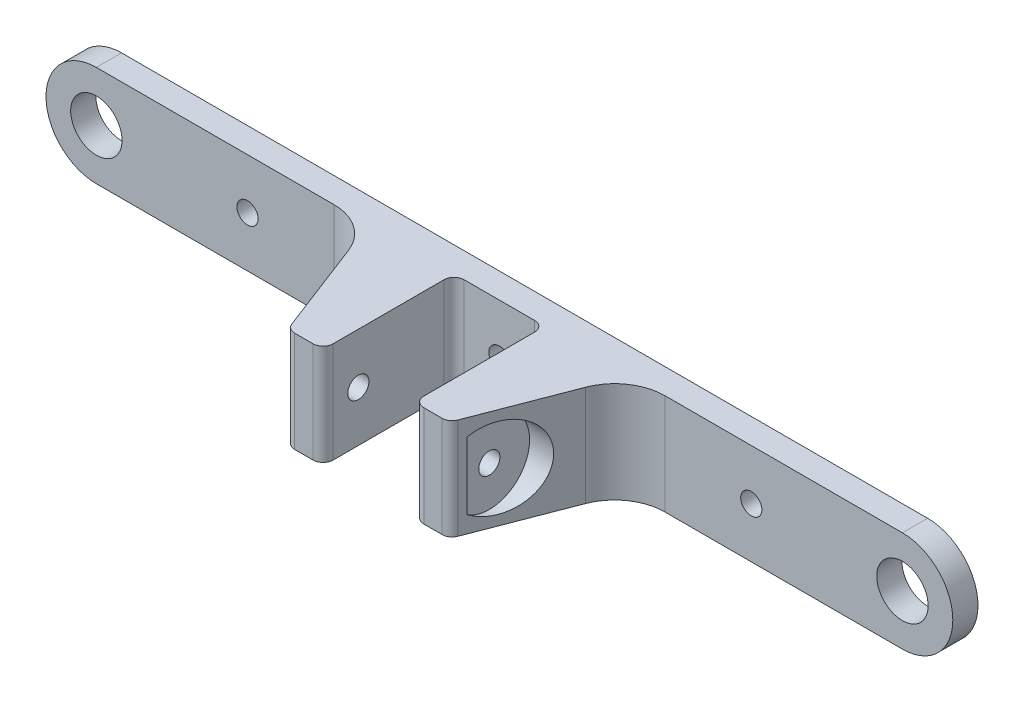
ISO-10303-21;
HEADER;
FILE_DESCRIPTION(('STEP AP214'),'2;1');
FILE_NAME('part.step','',(''),(''),'','','');
FILE_SCHEMA(('AUTOMOTIVE_DESIGN { 1 0 10303 214 1 1 1 1 }'));
ENDSEC;
DATA;
#1=APPLICATION_CONTEXT('core data for automotive mechanical design processes');
#2=APPLICATION_PROTOCOL_DEFINITION('international standard','automotive_design',2000,#1);
#3=PRODUCT_CONTEXT('',#1,'mechanical');
#4=PRODUCT('Part','Part','',(#3));
#5=PRODUCT_RELATED_PRODUCT_CATEGORY('part','',(#4));
#6=PRODUCT_DEFINITION_FORMATION('','',#4);
#7=PRODUCT_DEFINITION_CONTEXT('part definition',#1,'design');
#8=PRODUCT_DEFINITION('design','',#6,#7);
#9=PRODUCT_DEFINITION_SHAPE('','',#8);
#10=(LENGTH_UNIT() NAMED_UNIT(*) SI_UNIT(.MILLI.,.METRE.));
#11=(NAMED_UNIT(*) PLANE_ANGLE_UNIT() SI_UNIT($,.RADIAN.));
#12=(NAMED_UNIT(*) SI_UNIT($,.STERADIAN.) SOLID_ANGLE_UNIT());
#13=UNCERTAINTY_MEASURE_WITH_UNIT(LENGTH_MEASURE(1.E-05),#10,'distance_accuracy_value','');
#14=(GEOMETRIC_REPRESENTATION_CONTEXT(3) GLOBAL_UNCERTAINTY_ASSIGNED_CONTEXT((#13)) GLOBAL_UNIT_ASSIGNED_CONTEXT((#10,
#11,#12)) REPRESENTATION_CONTEXT('',''));
#15=CARTESIAN_POINT('',(0.,0.,0.));
#16=DIRECTION('',(0.,0.,1.));
#17=DIRECTION('',(1.,0.,0.));
#18=AXIS2_PLACEMENT_3D('',#15,#16,#17);
#19=CARTESIAN_POINT('',(0.,0.,31.));
#20=DIRECTION('',(0.,0.,-1.));
#21=DIRECTION('',(-1.,0.,0.));
#22=AXIS2_PLACEMENT_3D('',#19,#20,#21);
#23=PLANE('',#22);
#24=DIRECTION('',(-1.,0.,0.));
#25=VECTOR('',#24,1.);
#26=CARTESIAN_POINT('',(16.,10.,31.));
#27=LINE('',#26,#25);
#28=CARTESIAN_POINT('',(14.6264018035101,10.,31.));
#29=VERTEX_POINT('',#28);
#30=CARTESIAN_POINT('',(11.,10.,31.));
#31=VERTEX_POINT('',#30);
#32=EDGE_CURVE('E241',#29,#31,#27,.T.);
#33=ORIENTED_EDGE('',*,*,#32,.T.);
#34=DIRECTION('',(0.,1.,0.));
#35=VECTOR('',#34,1.);
#36=CARTESIAN_POINT('',(11.,0.,31.));
#37=LINE('',#36,#35);
#38=CARTESIAN_POINT('',(11.,-10.,31.));
#39=VERTEX_POINT('',#38);
#40=EDGE_CURVE('E233',#31,#39,#37,.F.);
#41=ORIENTED_EDGE('',*,*,#40,.T.);
#42=DIRECTION('',(1.,0.,0.));
#43=VECTOR('',#42,1.);
#44=CARTESIAN_POINT('',(16.,-10.,31.));
#45=LINE('',#44,#43);
#46=CARTESIAN_POINT('',(14.6264018035101,-10.,31.));
#47=VERTEX_POINT('',#46);
#48=EDGE_CURVE('E239',#39,#47,#45,.T.);
#49=ORIENTED_EDGE('',*,*,#48,.T.);
#50=DIRECTION('',(0.,1.,0.));
#51=VECTOR('',#50,1.);
#52=CARTESIAN_POINT('',(14.6264018035101,0.,31.));
#53=LINE('',#52,#51);
#54=EDGE_CURVE('E230',#47,#29,#53,.T.);
#55=ORIENTED_EDGE('',*,*,#54,.T.);
#56=EDGE_LOOP('',(#33,#41,#49,#55));
#57=FACE_BOUND('',#56,.T.);
#58=ADVANCED_FACE('F33',(#57),#23,.F.);
#59=CARTESIAN_POINT('',(-80.,0.,5.));
#60=DIRECTION('',(0.,0.,1.));
#61=DIRECTION('',(1.,0.,0.));
#62=AXIS2_PLACEMENT_3D('',#59,#60,#61);
#63=PLANE('',#62);
#64=DIRECTION('',(-1.,0.,0.));
#65=VECTOR('',#64,1.);
#66=CARTESIAN_POINT('',(-80.,10.,5.));
#67=LINE('',#66,#65);
#68=CARTESIAN_POINT('',(80.,10.,5.));
#69=VERTEX_POINT('',#68);
#70=CARTESIAN_POINT('',(32.8679909824493,10.,5.));
#71=VERTEX_POINT('',#70);
#72=EDGE_CURVE('E325',#69,#71,#67,.T.);
#73=ORIENTED_EDGE('',*,*,#72,.T.);
#74=DIRECTION('',(0.,-1.,0.));
#75=VECTOR('',#74,1.);
#76=CARTESIAN_POINT('',(32.8679909824493,0.,5.));
#77=LINE('',#76,#75);
#78=CARTESIAN_POINT('',(32.8679909824493,-10.,5.));
#79=VERTEX_POINT('',#78);
#80=EDGE_CURVE('E460',#71,#79,#77,.T.);
#81=ORIENTED_EDGE('',*,*,#80,.T.);
#82=DIRECTION('',(1.,0.,0.));
#83=VECTOR('',#82,1.);
#84=CARTESIAN_POINT('',(-80.,-10.,5.));
#85=LINE('',#84,#83);
#86=CARTESIAN_POINT('',(80.,-10.,5.));
#87=VERTEX_POINT('',#86);
#88=EDGE_CURVE('E308',#79,#87,#85,.T.);
#89=ORIENTED_EDGE('',*,*,#88,.T.);
#90=CARTESIAN_POINT('',(80.,0.,5.));
#91=DIRECTION('',(0.,0.,1.));
#92=DIRECTION('',(1.,0.,0.));
#93=AXIS2_PLACEMENT_3D('',#90,#91,#92);
#94=CIRCLE('',#93,10.);
#95=EDGE_CURVE('E312',#87,#69,#94,.T.);
#96=ORIENTED_EDGE('',*,*,#95,.T.);
#97=EDGE_LOOP('',(#73,#81,#89,#96));
#98=FACE_BOUND('',#97,.T.);
#99=CARTESIAN_POINT('',(80.,0.,5.));
#100=DIRECTION('',(0.,0.,1.));
#101=DIRECTION('',(1.,0.,0.));
#102=AXIS2_PLACEMENT_3D('',#99,#100,#101);
#103=CIRCLE('',#102,5.1);
#104=CARTESIAN_POINT('',(85.1,0.,5.));
#105=VERTEX_POINT('',#104);
#106=EDGE_CURVE('E290',#105,#105,#103,.T.);
#107=ORIENTED_EDGE('',*,*,#106,.F.);
#108=EDGE_LOOP('',(#107));
#109=FACE_BOUND('',#108,.T.);
#110=CARTESIAN_POINT('',(50.,0.,5.));
#111=DIRECTION('',(0.,0.,1.));
#112=DIRECTION('',(1.,0.,0.));
#113=AXIS2_PLACEMENT_3D('',#110,#111,#112);
#114=CIRCLE('',#113,2.1);
#115=CARTESIAN_POINT('',(52.1,0.,5.));
#116=VERTEX_POINT('',#115);
#117=EDGE_CURVE('E280',#116,#116,#114,.T.);
#118=ORIENTED_EDGE('',*,*,#117,.F.);
#119=EDGE_LOOP('',(#118));
#120=FACE_BOUND('',#119,.T.);
#121=ADVANCED_FACE('F421',(#98,#109,#120),#63,.T.);
#122=CARTESIAN_POINT('',(-80.,0.,5.));
#123=DIRECTION('',(0.,0.,-1.));
#124=DIRECTION('',(-1.,0.,0.));
#125=AXIS2_PLACEMENT_3D('',#122,#123,#124);
#126=CYLINDRICAL_SURFACE('',#125,10.);
#127=CARTESIAN_POINT('',(-80.,0.,0.));
#128=DIRECTION('',(0.,0.,1.));
#129=DIRECTION('',(1.,0.,0.));
#130=AXIS2_PLACEMENT_3D('',#127,#128,#129);
#131=CIRCLE('',#130,10.);
#132=CARTESIAN_POINT('',(-80.,10.,0.));
#133=VERTEX_POINT('',#132);
#134=CARTESIAN_POINT('',(-80.,-10.,0.));
#135=VERTEX_POINT('',#134);
#136=EDGE_CURVE('E302',#133,#135,#131,.T.);
#137=ORIENTED_EDGE('',*,*,#136,.T.);
#138=DIRECTION('',(0.,0.,-1.));
#139=VECTOR('',#138,1.);
#140=CARTESIAN_POINT('',(-80.,-10.,5.));
#141=LINE('',#140,#139);
#142=CARTESIAN_POINT('',(-80.,-10.,5.));
#143=VERTEX_POINT('',#142);
#144=EDGE_CURVE('E323',#143,#135,#141,.T.);
#145=ORIENTED_EDGE('',*,*,#144,.F.);
#146=CARTESIAN_POINT('',(-80.,0.,5.));
#147=DIRECTION('',(0.,0.,1.));
#148=DIRECTION('',(1.,0.,0.));
#149=AXIS2_PLACEMENT_3D('',#146,#147,#148);
#150=CIRCLE('',#149,10.);
#151=CARTESIAN_POINT('',(-80.,10.,5.));
#152=VERTEX_POINT('',#151);
#153=EDGE_CURVE('E305',#152,#143,#150,.T.);
#154=ORIENTED_EDGE('',*,*,#153,.F.);
#155=DIRECTION('',(0.,0.,-1.));
#156=VECTOR('',#155,1.);
#157=CARTESIAN_POINT('',(-80.,10.,5.));
#158=LINE('',#157,#156);
#159=EDGE_CURVE('E328',#152,#133,#158,.T.);
#160=ORIENTED_EDGE('',*,*,#159,.T.);
#161=EDGE_LOOP('',(#137,#145,#154,#160));
#162=FACE_BOUND('',#161,.T.);
#163=ADVANCED_FACE('F427',(#162),#126,.T.);
#164=CARTESIAN_POINT('',(-80.,-10.,5.));
#165=DIRECTION('',(0.,1.,0.));
#166=DIRECTION('',(0.,0.,1.));
#167=AXIS2_PLACEMENT_3D('',#164,#165,#166);
#168=PLANE('',#167);
#169=DIRECTION('',(0.,0.,1.));
#170=VECTOR('',#169,1.);
#171=CARTESIAN_POINT('',(-8.99999999999999,-10.,5.));
#172=LINE('',#171,#170);
#173=CARTESIAN_POINT('',(-8.99999999999999,-10.,7.));
#174=VERTEX_POINT('',#173);
#175=CARTESIAN_POINT('',(-8.99999999999999,-10.,29.));
#176=VERTEX_POINT('',#175);
#177=EDGE_CURVE('E270',#174,#176,#172,.T.);
#178=ORIENTED_EDGE('',*,*,#177,.T.);
#179=CARTESIAN_POINT('',(-11.,-10.,29.));
#180=DIRECTION('',(0.,1.,0.));
#181=DIRECTION('',(0.,0.,1.));
#182=AXIS2_PLACEMENT_3D('',#179,#180,#181);
#183=CIRCLE('',#182,2.);
#184=CARTESIAN_POINT('',(-11.,-10.,31.));
#185=VERTEX_POINT('',#184);
#186=EDGE_CURVE('E213',#176,#185,#183,.F.);
#187=ORIENTED_EDGE('',*,*,#186,.T.);
#188=CARTESIAN_POINT('',(-14.6264018035101,-10.,31.));
#189=VERTEX_POINT('',#188);
#190=EDGE_CURVE('E251',#189,#185,#45,.T.);
#191=ORIENTED_EDGE('',*,*,#190,.F.);
#192=CARTESIAN_POINT('',(-14.6264018035101,-10.,29.));
#193=DIRECTION('',(0.,1.,0.));
#194=DIRECTION('',(0.,0.,1.));
#195=AXIS2_PLACEMENT_3D('',#192,#193,#194);
#196=CIRCLE('',#195,2.);
#197=CARTESIAN_POINT('',(-16.4930930159162,-10.,29.7179581586178));
#198=VERTEX_POINT('',#197);
#199=EDGE_CURVE('E209',#189,#198,#196,.F.);
#200=ORIENTED_EDGE('',*,*,#199,.T.);
#201=DIRECTION('',(-0.358979079308872,0.,-0.933345606203059));
#202=VECTOR('',#201,1.);
#203=CARTESIAN_POINT('',(-32.9587628865981,-10.,-13.0927835051547));
#204=LINE('',#203,#202);
#205=CARTESIAN_POINT('',(-23.5345349204187,-10.,11.4102092069113));
#206=VERTEX_POINT('',#205);
#207=EDGE_CURVE('E454',#198,#206,#204,.T.);
#208=ORIENTED_EDGE('',*,*,#207,.T.);
#209=CARTESIAN_POINT('',(-32.8679909824493,-10.,15.));
#210=DIRECTION('',(0.,1.,0.));
#211=DIRECTION('',(0.,0.,1.));
#212=AXIS2_PLACEMENT_3D('',#209,#210,#211);
#213=CIRCLE('',#212,10.);
#214=CARTESIAN_POINT('',(-32.8679909824493,-10.,5.));
#215=VERTEX_POINT('',#214);
#216=EDGE_CURVE('E352',#206,#215,#213,.T.);
#217=ORIENTED_EDGE('',*,*,#216,.T.);
#218=EDGE_CURVE('E319',#143,#215,#85,.T.);
#219=ORIENTED_EDGE('',*,*,#218,.F.);
#220=ORIENTED_EDGE('',*,*,#144,.T.);
#221=DIRECTION('',(1.,0.,0.));
#222=VECTOR('',#221,1.);
#223=CARTESIAN_POINT('',(-80.,-10.,0.));
#224=LINE('',#223,#222);
#225=CARTESIAN_POINT('',(80.,-10.,0.));
#226=VERTEX_POINT('',#225);
#227=EDGE_CURVE('E480',#135,#226,#224,.T.);
#228=ORIENTED_EDGE('',*,*,#227,.T.);
#229=DIRECTION('',(0.,0.,-1.));
#230=VECTOR('',#229,1.);
#231=CARTESIAN_POINT('',(80.,-10.,5.));
#232=LINE('',#231,#230);
#233=EDGE_CURVE('E464',#87,#226,#232,.T.);
#234=ORIENTED_EDGE('',*,*,#233,.F.);
#235=ORIENTED_EDGE('',*,*,#88,.F.);
#236=CARTESIAN_POINT('',(32.8679909824493,-10.,15.));
#237=DIRECTION('',(0.,1.,0.));
#238=DIRECTION('',(0.,0.,1.));
#239=AXIS2_PLACEMENT_3D('',#236,#237,#238);
#240=CIRCLE('',#239,10.);
#241=CARTESIAN_POINT('',(23.5345349204187,-10.,11.4102092069113));
#242=VERTEX_POINT('',#241);
#243=EDGE_CURVE('E346',#79,#242,#240,.T.);
#244=ORIENTED_EDGE('',*,*,#243,.T.);
#245=DIRECTION('',(-0.358979079308872,0.,0.933345606203059));
#246=VECTOR('',#245,1.);
#247=CARTESIAN_POINT('',(12.3402061855668,-10.,40.515463917526));
#248=LINE('',#247,#246);
#249=CARTESIAN_POINT('',(16.4930930159162,-10.,29.7179581586177));
#250=VERTEX_POINT('',#249);
#251=EDGE_CURVE('E458',#242,#250,#248,.T.);
#252=ORIENTED_EDGE('',*,*,#251,.T.);
#253=CARTESIAN_POINT('',(14.6264018035101,-10.,29.));
#254=DIRECTION('',(0.,1.,0.));
#255=DIRECTION('',(0.,0.,1.));
#256=AXIS2_PLACEMENT_3D('',#253,#254,#255);
#257=CIRCLE('',#256,2.);
#258=EDGE_CURVE('E201',#250,#47,#257,.F.);
#259=ORIENTED_EDGE('',*,*,#258,.T.);
#260=ORIENTED_EDGE('',*,*,#48,.F.);
#261=CARTESIAN_POINT('',(11.,-10.,29.));
#262=DIRECTION('',(0.,1.,0.));
#263=DIRECTION('',(0.,0.,1.));
#264=AXIS2_PLACEMENT_3D('',#261,#262,#263);
#265=CIRCLE('',#264,2.);
#266=CARTESIAN_POINT('',(9.00000000000001,-10.,29.));
#267=VERTEX_POINT('',#266);
#268=EDGE_CURVE('E211',#39,#267,#265,.F.);
#269=ORIENTED_EDGE('',*,*,#268,.T.);
#270=DIRECTION('',(0.,0.,1.));
#271=VECTOR('',#270,1.);
#272=CARTESIAN_POINT('',(9.00000000000001,-10.,5.));
#273=LINE('',#272,#271);
#274=CARTESIAN_POINT('',(9.00000000000001,-10.,7.));
#275=VERTEX_POINT('',#274);
#276=EDGE_CURVE('E261',#275,#267,#273,.T.);
#277=ORIENTED_EDGE('',*,*,#276,.F.);
#278=CARTESIAN_POINT('',(7.,-10.,7.));
#279=DIRECTION('',(0.,1.,0.));
#280=DIRECTION('',(0.,0.,1.));
#281=AXIS2_PLACEMENT_3D('',#278,#279,#280);
#282=CIRCLE('',#281,2.);
#283=CARTESIAN_POINT('',(7.,-10.,5.));
#284=VERTEX_POINT('',#283);
#285=EDGE_CURVE('E204',#275,#284,#282,.T.);
#286=ORIENTED_EDGE('',*,*,#285,.T.);
#287=DIRECTION('',(1.,0.,0.));
#288=VECTOR('',#287,1.);
#289=CARTESIAN_POINT('',(9.00000000000001,-10.,5.));
#290=LINE('',#289,#288);
#291=CARTESIAN_POINT('',(-7.,-10.,5.));
#292=VERTEX_POINT('',#291);
#293=EDGE_CURVE('E267',#292,#284,#290,.T.);
#294=ORIENTED_EDGE('',*,*,#293,.F.);
#295=CARTESIAN_POINT('',(-6.99999999999999,-10.,7.));
#296=DIRECTION('',(0.,1.,0.));
#297=DIRECTION('',(0.,0.,1.));
#298=AXIS2_PLACEMENT_3D('',#295,#296,#297);
#299=CIRCLE('',#298,2.);
#300=EDGE_CURVE('E364',#292,#174,#299,.T.);
#301=ORIENTED_EDGE('',*,*,#300,.T.);
#302=EDGE_LOOP('',(#178,#187,#191,#200,#208,#217,#219,#220,#228,#234,#235,#244,#252,#259,#260,
#269,#277,#286,#294,#301));
#303=FACE_BOUND('',#302,.T.);
#304=ADVANCED_FACE('F246',(#303),#168,.F.);
#305=CARTESIAN_POINT('',(80.,0.,5.));
#306=DIRECTION('',(0.,0.,-1.));
#307=DIRECTION('',(-1.,0.,0.));
#308=AXIS2_PLACEMENT_3D('',#305,#306,#307);
#309=CYLINDRICAL_SURFACE('',#308,10.);
#310=CARTESIAN_POINT('',(80.,0.,0.));
#311=DIRECTION('',(0.,0.,1.));
#312=DIRECTION('',(1.,0.,0.));
#313=AXIS2_PLACEMENT_3D('',#310,#311,#312);
#314=CIRCLE('',#313,10.);
#315=CARTESIAN_POINT('',(80.,10.,0.));
#316=VERTEX_POINT('',#315);
#317=EDGE_CURVE('E479',#226,#316,#314,.T.);
#318=ORIENTED_EDGE('',*,*,#317,.T.);
#319=DIRECTION('',(0.,0.,-1.));
#320=VECTOR('',#319,1.);
#321=CARTESIAN_POINT('',(80.,10.,5.));
#322=LINE('',#321,#320);
#323=EDGE_CURVE('E468',#69,#316,#322,.T.);
#324=ORIENTED_EDGE('',*,*,#323,.F.);
#325=ORIENTED_EDGE('',*,*,#95,.F.);
#326=ORIENTED_EDGE('',*,*,#233,.T.);
#327=EDGE_LOOP('',(#318,#324,#325,#326));
#328=FACE_BOUND('',#327,.T.);
#329=ADVANCED_FACE('F489',(#328),#309,.T.);
#330=CARTESIAN_POINT('',(-80.,10.,5.));
#331=DIRECTION('',(0.,-1.,0.));
#332=DIRECTION('',(0.,0.,-1.));
#333=AXIS2_PLACEMENT_3D('',#330,#331,#332);
#334=PLANE('',#333);
#335=CARTESIAN_POINT('',(-11.,10.,31.));
#336=VERTEX_POINT('',#335);
#337=CARTESIAN_POINT('',(-14.6264018035101,10.,31.));
#338=VERTEX_POINT('',#337);
#339=EDGE_CURVE('E277',#336,#338,#27,.T.);
#340=ORIENTED_EDGE('',*,*,#339,.F.);
#341=CARTESIAN_POINT('',(-11.,10.,29.));
#342=DIRECTION('',(0.,-1.,0.));
#343=DIRECTION('',(0.,0.,-1.));
#344=AXIS2_PLACEMENT_3D('',#341,#342,#343);
#345=CIRCLE('',#344,2.);
#346=CARTESIAN_POINT('',(-8.99999999999999,10.,29.));
#347=VERTEX_POINT('',#346);
#348=EDGE_CURVE('E225',#336,#347,#345,.F.);
#349=ORIENTED_EDGE('',*,*,#348,.T.);
#350=DIRECTION('',(0.,0.,1.));
#351=VECTOR('',#350,1.);
#352=CARTESIAN_POINT('',(-8.99999999999999,10.,5.));
#353=LINE('',#352,#351);
#354=CARTESIAN_POINT('',(-8.99999999999999,10.,7.));
#355=VERTEX_POINT('',#354);
#356=EDGE_CURVE('E266',#355,#347,#353,.T.);
#357=ORIENTED_EDGE('',*,*,#356,.F.);
#358=CARTESIAN_POINT('',(-6.99999999999999,10.,7.));
#359=DIRECTION('',(0.,-1.,0.));
#360=DIRECTION('',(0.,0.,-1.));
#361=AXIS2_PLACEMENT_3D('',#358,#359,#360);
#362=CIRCLE('',#361,2.);
#363=CARTESIAN_POINT('',(-7.,10.,5.));
#364=VERTEX_POINT('',#363);
#365=EDGE_CURVE('E366',#355,#364,#362,.T.);
#366=ORIENTED_EDGE('',*,*,#365,.T.);
#367=DIRECTION('',(-1.,0.,0.));
#368=VECTOR('',#367,1.);
#369=CARTESIAN_POINT('',(9.00000000000001,10.,5.));
#370=LINE('',#369,#368);
#371=CARTESIAN_POINT('',(7.,10.,5.));
#372=VERTEX_POINT('',#371);
#373=EDGE_CURVE('E273',#372,#364,#370,.T.);
#374=ORIENTED_EDGE('',*,*,#373,.F.);
#375=CARTESIAN_POINT('',(7.,10.,7.));
#376=DIRECTION('',(0.,-1.,0.));
#377=DIRECTION('',(0.,0.,-1.));
#378=AXIS2_PLACEMENT_3D('',#375,#376,#377);
#379=CIRCLE('',#378,2.);
#380=CARTESIAN_POINT('',(9.00000000000001,10.,7.));
#381=VERTEX_POINT('',#380);
#382=EDGE_CURVE('E265',#372,#381,#379,.T.);
#383=ORIENTED_EDGE('',*,*,#382,.T.);
#384=DIRECTION('',(0.,0.,1.));
#385=VECTOR('',#384,1.);
#386=CARTESIAN_POINT('',(9.00000000000001,10.,5.));
#387=LINE('',#386,#385);
#388=CARTESIAN_POINT('',(9.00000000000001,10.,29.));
#389=VERTEX_POINT('',#388);
#390=EDGE_CURVE('E259',#381,#389,#387,.T.);
#391=ORIENTED_EDGE('',*,*,#390,.T.);
#392=CARTESIAN_POINT('',(11.,10.,29.));
#393=DIRECTION('',(0.,-1.,0.));
#394=DIRECTION('',(0.,0.,-1.));
#395=AXIS2_PLACEMENT_3D('',#392,#393,#394);
#396=CIRCLE('',#395,2.);
#397=EDGE_CURVE('E223',#389,#31,#396,.F.);
#398=ORIENTED_EDGE('',*,*,#397,.T.);
#399=ORIENTED_EDGE('',*,*,#32,.F.);
#400=CARTESIAN_POINT('',(14.6264018035101,10.,29.));
#401=DIRECTION('',(0.,-1.,0.));
#402=DIRECTION('',(0.,0.,-1.));
#403=AXIS2_PLACEMENT_3D('',#400,#401,#402);
#404=CIRCLE('',#403,2.);
#405=CARTESIAN_POINT('',(16.4930930159162,10.,29.7179581586177));
#406=VERTEX_POINT('',#405);
#407=EDGE_CURVE('E55',#29,#406,#404,.F.);
#408=ORIENTED_EDGE('',*,*,#407,.T.);
#409=DIRECTION('',(0.358979079308872,0.,-0.933345606203059));
#410=VECTOR('',#409,1.);
#411=CARTESIAN_POINT('',(12.3402061855668,10.,40.515463917526));
#412=LINE('',#411,#410);
#413=CARTESIAN_POINT('',(23.5345349204187,10.,11.4102092069113));
#414=VERTEX_POINT('',#413);
#415=EDGE_CURVE('E330',#406,#414,#412,.T.);
#416=ORIENTED_EDGE('',*,*,#415,.T.);
#417=CARTESIAN_POINT('',(32.8679909824493,10.,15.));
#418=DIRECTION('',(0.,-1.,0.));
#419=DIRECTION('',(0.,0.,-1.));
#420=AXIS2_PLACEMENT_3D('',#417,#418,#419);
#421=CIRCLE('',#420,10.);
#422=EDGE_CURVE('E348',#414,#71,#421,.T.);
#423=ORIENTED_EDGE('',*,*,#422,.T.);
#424=ORIENTED_EDGE('',*,*,#72,.F.);
#425=ORIENTED_EDGE('',*,*,#323,.T.);
#426=DIRECTION('',(-1.,0.,0.));
#427=VECTOR('',#426,1.);
#428=CARTESIAN_POINT('',(-80.,10.,0.));
#429=LINE('',#428,#427);
#430=EDGE_CURVE('E309',#316,#133,#429,.T.);
#431=ORIENTED_EDGE('',*,*,#430,.T.);
#432=ORIENTED_EDGE('',*,*,#159,.F.);
#433=CARTESIAN_POINT('',(-32.8679909824493,10.,5.));
#434=VERTEX_POINT('',#433);
#435=EDGE_CURVE('E329',#434,#152,#67,.T.);
#436=ORIENTED_EDGE('',*,*,#435,.F.);
#437=CARTESIAN_POINT('',(-32.8679909824493,10.,15.));
#438=DIRECTION('',(0.,-1.,0.));
#439=DIRECTION('',(0.,0.,-1.));
#440=AXIS2_PLACEMENT_3D('',#437,#438,#439);
#441=CIRCLE('',#440,10.);
#442=CARTESIAN_POINT('',(-23.5345349204187,10.,11.4102092069113));
#443=VERTEX_POINT('',#442);
#444=EDGE_CURVE('E350',#434,#443,#441,.T.);
#445=ORIENTED_EDGE('',*,*,#444,.T.);
#446=DIRECTION('',(0.358979079308872,0.,0.933345606203059));
#447=VECTOR('',#446,1.);
#448=CARTESIAN_POINT('',(-32.9587628865981,10.,-13.0927835051547));
#449=LINE('',#448,#447);
#450=CARTESIAN_POINT('',(-16.4930930159162,10.,29.7179581586178));
#451=VERTEX_POINT('',#450);
#452=EDGE_CURVE('E457',#443,#451,#449,.T.);
#453=ORIENTED_EDGE('',*,*,#452,.T.);
#454=CARTESIAN_POINT('',(-14.6264018035101,10.,29.));
#455=DIRECTION('',(0.,-1.,0.));
#456=DIRECTION('',(0.,0.,-1.));
#457=AXIS2_PLACEMENT_3D('',#454,#455,#456);
#458=CIRCLE('',#457,2.);
#459=EDGE_CURVE('E221',#451,#338,#458,.F.);
#460=ORIENTED_EDGE('',*,*,#459,.T.);
#461=EDGE_LOOP('',(#340,#349,#357,#366,#374,#383,#391,#398,#399,#408,#416,#423,#424,#425,#431,
#432,#436,#445,#453,#460));
#462=FACE_BOUND('',#461,.T.);
#463=ADVANCED_FACE('F263',(#462),#334,.F.);
#464=ORIENTED_EDGE('',*,*,#218,.T.);
#465=DIRECTION('',(0.,1.,0.));
#466=VECTOR('',#465,1.);
#467=CARTESIAN_POINT('',(-32.8679909824493,0.,5.));
#468=LINE('',#467,#466);
#469=EDGE_CURVE('E340',#215,#434,#468,.T.);
#470=ORIENTED_EDGE('',*,*,#469,.T.);
#471=ORIENTED_EDGE('',*,*,#435,.T.);
#472=ORIENTED_EDGE('',*,*,#153,.T.);
#473=EDGE_LOOP('',(#464,#470,#471,#472));
#474=FACE_BOUND('',#473,.T.);
#475=CARTESIAN_POINT('',(-50.,0.,5.));
#476=DIRECTION('',(0.,0.,1.));
#477=DIRECTION('',(1.,0.,0.));
#478=AXIS2_PLACEMENT_3D('',#475,#476,#477);
#479=CIRCLE('',#478,2.1);
#480=CARTESIAN_POINT('',(-47.9,0.,5.));
#481=VERTEX_POINT('',#480);
#482=EDGE_CURVE('E284',#481,#481,#479,.T.);
#483=ORIENTED_EDGE('',*,*,#482,.F.);
#484=EDGE_LOOP('',(#483));
#485=FACE_BOUND('',#484,.T.);
#486=CARTESIAN_POINT('',(-80.,0.,5.));
#487=DIRECTION('',(0.,0.,1.));
#488=DIRECTION('',(1.,0.,0.));
#489=AXIS2_PLACEMENT_3D('',#486,#487,#488);
#490=CIRCLE('',#489,5.1);
#491=CARTESIAN_POINT('',(-74.9,0.,5.));
#492=VERTEX_POINT('',#491);
#493=EDGE_CURVE('E296',#492,#492,#490,.T.);
#494=ORIENTED_EDGE('',*,*,#493,.F.);
#495=EDGE_LOOP('',(#494));
#496=FACE_BOUND('',#495,.T.);
#497=ADVANCED_FACE('F430',(#474,#485,#496),#63,.T.);
#498=CARTESIAN_POINT('',(-80.,0.,0.));
#499=DIRECTION('',(0.,0.,1.));
#500=DIRECTION('',(1.,0.,0.));
#501=AXIS2_PLACEMENT_3D('',#498,#499,#500);
#502=PLANE('',#501);
#503=CARTESIAN_POINT('',(0.,0.,0.));
#504=DIRECTION('',(0.,0.,1.));
#505=DIRECTION('',(1.,0.,0.));
#506=AXIS2_PLACEMENT_3D('',#503,#504,#505);
#507=CIRCLE('',#506,2.1);
#508=CARTESIAN_POINT('',(2.1,0.,0.));
#509=VERTEX_POINT('',#508);
#510=EDGE_CURVE('E194',#509,#509,#507,.T.);
#511=ORIENTED_EDGE('',*,*,#510,.T.);
#512=EDGE_LOOP('',(#511));
#513=FACE_BOUND('',#512,.T.);
#514=CARTESIAN_POINT('',(50.,0.,0.));
#515=DIRECTION('',(0.,0.,1.));
#516=DIRECTION('',(1.,0.,0.));
#517=AXIS2_PLACEMENT_3D('',#514,#515,#516);
#518=CIRCLE('',#517,2.1);
#519=CARTESIAN_POINT('',(52.1,0.,0.));
#520=VERTEX_POINT('',#519);
#521=EDGE_CURVE('E281',#520,#520,#518,.T.);
#522=ORIENTED_EDGE('',*,*,#521,.T.);
#523=EDGE_LOOP('',(#522));
#524=FACE_BOUND('',#523,.T.);
#525=CARTESIAN_POINT('',(-50.,0.,0.));
#526=DIRECTION('',(0.,0.,1.));
#527=DIRECTION('',(1.,0.,0.));
#528=AXIS2_PLACEMENT_3D('',#525,#526,#527);
#529=CIRCLE('',#528,2.1);
#530=CARTESIAN_POINT('',(-47.9,0.,0.));
#531=VERTEX_POINT('',#530);
#532=EDGE_CURVE('E287',#531,#531,#529,.T.);
#533=ORIENTED_EDGE('',*,*,#532,.T.);
#534=EDGE_LOOP('',(#533));
#535=FACE_BOUND('',#534,.T.);
#536=CARTESIAN_POINT('',(80.,0.,0.));
#537=DIRECTION('',(0.,0.,1.));
#538=DIRECTION('',(1.,0.,0.));
#539=AXIS2_PLACEMENT_3D('',#536,#537,#538);
#540=CIRCLE('',#539,5.1);
#541=CARTESIAN_POINT('',(85.1,0.,0.));
#542=VERTEX_POINT('',#541);
#543=EDGE_CURVE('E293',#542,#542,#540,.T.);
#544=ORIENTED_EDGE('',*,*,#543,.T.);
#545=EDGE_LOOP('',(#544));
#546=FACE_BOUND('',#545,.T.);
#547=CARTESIAN_POINT('',(-80.,0.,0.));
#548=DIRECTION('',(0.,0.,1.));
#549=DIRECTION('',(1.,0.,0.));
#550=AXIS2_PLACEMENT_3D('',#547,#548,#549);
#551=CIRCLE('',#550,5.1);
#552=CARTESIAN_POINT('',(-74.9,0.,0.));
#553=VERTEX_POINT('',#552);
#554=EDGE_CURVE('E299',#553,#553,#551,.T.);
#555=ORIENTED_EDGE('',*,*,#554,.T.);
#556=EDGE_LOOP('',(#555));
#557=FACE_BOUND('',#556,.T.);
#558=ORIENTED_EDGE('',*,*,#136,.F.);
#559=ORIENTED_EDGE('',*,*,#430,.F.);
#560=ORIENTED_EDGE('',*,*,#317,.F.);
#561=ORIENTED_EDGE('',*,*,#227,.F.);
#562=EDGE_LOOP('',(#558,#559,#560,#561));
#563=FACE_BOUND('',#562,.T.);
#564=ADVANCED_FACE('F487',(#513,#524,#535,#546,#557,#563),#502,.F.);
#565=CARTESIAN_POINT('',(-80.,0.,0.));
#566=DIRECTION('',(0.,0.,1.));
#567=DIRECTION('',(1.,0.,0.));
#568=AXIS2_PLACEMENT_3D('',#565,#566,#567);
#569=CYLINDRICAL_SURFACE('',#568,5.1);
#570=ORIENTED_EDGE('',*,*,#554,.F.);
#571=EDGE_LOOP('',(#570));
#572=FACE_BOUND('',#571,.T.);
#573=ORIENTED_EDGE('',*,*,#493,.T.);
#574=EDGE_LOOP('',(#573));
#575=FACE_BOUND('',#574,.T.);
#576=ADVANCED_FACE('F565',(#572,#575),#569,.F.);
#577=CARTESIAN_POINT('',(80.,0.,0.));
#578=DIRECTION('',(0.,0.,1.));
#579=DIRECTION('',(1.,0.,0.));
#580=AXIS2_PLACEMENT_3D('',#577,#578,#579);
#581=CYLINDRICAL_SURFACE('',#580,5.1);
#582=ORIENTED_EDGE('',*,*,#543,.F.);
#583=EDGE_LOOP('',(#582));
#584=FACE_BOUND('',#583,.T.);
#585=ORIENTED_EDGE('',*,*,#106,.T.);
#586=EDGE_LOOP('',(#585));
#587=FACE_BOUND('',#586,.T.);
#588=ADVANCED_FACE('F572',(#584,#587),#581,.F.);
#589=CARTESIAN_POINT('',(-50.,0.,0.));
#590=DIRECTION('',(0.,0.,1.));
#591=DIRECTION('',(1.,0.,0.));
#592=AXIS2_PLACEMENT_3D('',#589,#590,#591);
#593=CYLINDRICAL_SURFACE('',#592,2.1);
#594=ORIENTED_EDGE('',*,*,#532,.F.);
#595=EDGE_LOOP('',(#594));
#596=FACE_BOUND('',#595,.T.);
#597=ORIENTED_EDGE('',*,*,#482,.T.);
#598=EDGE_LOOP('',(#597));
#599=FACE_BOUND('',#598,.T.);
#600=ADVANCED_FACE('F443',(#596,#599),#593,.F.);
#601=CARTESIAN_POINT('',(50.,0.,0.));
#602=DIRECTION('',(0.,0.,1.));
#603=DIRECTION('',(1.,0.,0.));
#604=AXIS2_PLACEMENT_3D('',#601,#602,#603);
#605=CYLINDRICAL_SURFACE('',#604,2.1);
#606=ORIENTED_EDGE('',*,*,#521,.F.);
#607=EDGE_LOOP('',(#606));
#608=FACE_BOUND('',#607,.T.);
#609=ORIENTED_EDGE('',*,*,#117,.T.);
#610=EDGE_LOOP('',(#609));
#611=FACE_BOUND('',#610,.T.);
#612=ADVANCED_FACE('F435',(#608,#611),#605,.F.);
#613=ORIENTED_EDGE('',*,*,#190,.T.);
#614=DIRECTION('',(0.,-1.,0.));
#615=VECTOR('',#614,1.);
#616=CARTESIAN_POINT('',(-11.,0.,31.));
#617=LINE('',#616,#615);
#618=EDGE_CURVE('E218',#185,#336,#617,.F.);
#619=ORIENTED_EDGE('',*,*,#618,.T.);
#620=ORIENTED_EDGE('',*,*,#339,.T.);
#621=DIRECTION('',(0.,-1.,0.));
#622=VECTOR('',#621,1.);
#623=CARTESIAN_POINT('',(-14.6264018035101,0.,31.));
#624=LINE('',#623,#622);
#625=EDGE_CURVE('E215',#338,#189,#624,.T.);
#626=ORIENTED_EDGE('',*,*,#625,.T.);
#627=EDGE_LOOP('',(#613,#619,#620,#626));
#628=FACE_BOUND('',#627,.T.);
#629=ADVANCED_FACE('F423',(#628),#23,.F.);
#630=CARTESIAN_POINT('',(16.,10.,30.9999999999998));
#631=DIRECTION('',(-0.933345606203059,0.,-0.358979079308872));
#632=DIRECTION('',(0.,1.,0.));
#633=AXIS2_PLACEMENT_3D('',#630,#631,#632);
#634=PLANE('',#633);
#635=DIRECTION('',(0.,1.,0.));
#636=VECTOR('',#635,1.);
#637=CARTESIAN_POINT('',(17.,10.,28.3999999999998));
#638=LINE('',#637,#636);
#639=CARTESIAN_POINT('',(17.,-6.68131723539614,28.3999999999998));
#640=VERTEX_POINT('',#639);
#641=CARTESIAN_POINT('',(17.,6.68131723539615,28.3999999999998));
#642=VERTEX_POINT('',#641);
#643=EDGE_CURVE('E374',#640,#642,#638,.T.);
#644=ORIENTED_EDGE('',*,*,#643,.T.);
#645=CARTESIAN_POINT('',(18.6923076923076,0.,24.));
#646=DIRECTION('',(-0.933345606203059,0.,-0.358979079308872));
#647=DIRECTION('',(-0.358979079308872,0.,0.933345606203059));
#648=AXIS2_PLACEMENT_3D('',#645,#646,#647);
#649=ELLIPSE('',#648,8.57131586288254,8.);
#650=EDGE_CURVE('E198',#642,#640,#649,.T.);
#651=ORIENTED_EDGE('',*,*,#650,.T.);
#652=EDGE_LOOP('',(#644,#651));
#653=FACE_BOUND('',#652,.T.);
#654=ORIENTED_EDGE('',*,*,#415,.F.);
#655=DIRECTION('',(0.,1.,0.));
#656=VECTOR('',#655,1.);
#657=CARTESIAN_POINT('',(16.4930930159162,10.,29.7179581586177));
#658=LINE('',#657,#656);
#659=EDGE_CURVE('E11',#406,#250,#658,.F.);
#660=ORIENTED_EDGE('',*,*,#659,.T.);
#661=ORIENTED_EDGE('',*,*,#251,.F.);
#662=DIRECTION('',(0.,-1.,0.));
#663=VECTOR('',#662,1.);
#664=CARTESIAN_POINT('',(23.5345349204187,10.,11.4102092069113));
#665=LINE('',#664,#663);
#666=EDGE_CURVE('E339',#242,#414,#665,.F.);
#667=ORIENTED_EDGE('',*,*,#666,.T.);
#668=EDGE_LOOP('',(#654,#660,#661,#667));
#669=FACE_BOUND('',#668,.T.);
#670=ADVANCED_FACE('F434',(#653,#669),#634,.F.);
#671=CARTESIAN_POINT('',(-16.,10.,30.9999999999998));
#672=DIRECTION('',(0.933345606203059,0.,-0.358979079308872));
#673=DIRECTION('',(0.,-1.,0.));
#674=AXIS2_PLACEMENT_3D('',#671,#672,#673);
#675=PLANE('',#674);
#676=DIRECTION('',(0.,-1.,0.));
#677=VECTOR('',#676,1.);
#678=CARTESIAN_POINT('',(-17.,10.,28.3999999999998));
#679=LINE('',#678,#677);
#680=CARTESIAN_POINT('',(-17.,6.68131723539613,28.3999999999998));
#681=VERTEX_POINT('',#680);
#682=CARTESIAN_POINT('',(-17.,-6.68131723539613,28.3999999999998));
#683=VERTEX_POINT('',#682);
#684=EDGE_CURVE('E181',#681,#683,#679,.T.);
#685=ORIENTED_EDGE('',*,*,#684,.T.);
#686=CARTESIAN_POINT('',(-18.6923076923076,0.,24.));
#687=DIRECTION('',(0.933345606203059,0.,-0.358979079308872));
#688=DIRECTION('',(0.358979079308872,0.,0.933345606203059));
#689=AXIS2_PLACEMENT_3D('',#686,#687,#688);
#690=ELLIPSE('',#689,8.57131586288255,8.);
#691=EDGE_CURVE('E193',#683,#681,#690,.T.);
#692=ORIENTED_EDGE('',*,*,#691,.T.);
#693=EDGE_LOOP('',(#685,#692));
#694=FACE_BOUND('',#693,.T.);
#695=ORIENTED_EDGE('',*,*,#207,.F.);
#696=DIRECTION('',(0.,-1.,0.));
#697=VECTOR('',#696,1.);
#698=CARTESIAN_POINT('',(-16.4930930159162,10.,29.7179581586177));
#699=LINE('',#698,#697);
#700=EDGE_CURVE('E41',#198,#451,#699,.F.);
#701=ORIENTED_EDGE('',*,*,#700,.T.);
#702=ORIENTED_EDGE('',*,*,#452,.F.);
#703=DIRECTION('',(0.,1.,0.));
#704=VECTOR('',#703,1.);
#705=CARTESIAN_POINT('',(-23.5345349204187,10.,11.4102092069113));
#706=LINE('',#705,#704);
#707=EDGE_CURVE('E343',#443,#206,#706,.F.);
#708=ORIENTED_EDGE('',*,*,#707,.T.);
#709=EDGE_LOOP('',(#695,#701,#702,#708));
#710=FACE_BOUND('',#709,.T.);
#711=ADVANCED_FACE('F196',(#694,#710),#675,.F.);
#712=CARTESIAN_POINT('',(32.8679909824493,0.,15.));
#713=DIRECTION('',(0.,-1.,0.));
#714=DIRECTION('',(1.,0.,0.));
#715=AXIS2_PLACEMENT_3D('',#712,#713,#714);
#716=CYLINDRICAL_SURFACE('',#715,10.);
#717=ORIENTED_EDGE('',*,*,#422,.F.);
#718=ORIENTED_EDGE('',*,*,#666,.F.);
#719=ORIENTED_EDGE('',*,*,#243,.F.);
#720=ORIENTED_EDGE('',*,*,#80,.F.);
#721=EDGE_LOOP('',(#717,#718,#719,#720));
#722=FACE_BOUND('',#721,.T.);
#723=ADVANCED_FACE('F497',(#722),#716,.F.);
#724=CARTESIAN_POINT('',(-32.8679909824493,0.,15.));
#725=DIRECTION('',(0.,1.,0.));
#726=DIRECTION('',(0.,0.,1.));
#727=AXIS2_PLACEMENT_3D('',#724,#725,#726);
#728=CYLINDRICAL_SURFACE('',#727,10.);
#729=ORIENTED_EDGE('',*,*,#216,.F.);
#730=ORIENTED_EDGE('',*,*,#707,.F.);
#731=ORIENTED_EDGE('',*,*,#444,.F.);
#732=ORIENTED_EDGE('',*,*,#469,.F.);
#733=EDGE_LOOP('',(#729,#730,#731,#732));
#734=FACE_BOUND('',#733,.T.);
#735=ADVANCED_FACE('F540',(#734),#728,.F.);
#736=CARTESIAN_POINT('',(9.00000000000001,-10.,5.));
#737=DIRECTION('',(1.,0.,0.));
#738=DIRECTION('',(0.,0.,-1.));
#739=AXIS2_PLACEMENT_3D('',#736,#737,#738);
#740=PLANE('',#739);
#741=CARTESIAN_POINT('',(9.00000000000001,0.,24.));
#742=DIRECTION('',(1.,0.,0.));
#743=DIRECTION('',(0.,0.,-1.));
#744=AXIS2_PLACEMENT_3D('',#741,#742,#743);
#745=CIRCLE('',#744,2.1);
#746=CARTESIAN_POINT('',(9.00000000000001,0.,21.9));
#747=VERTEX_POINT('',#746);
#748=EDGE_CURVE('E373',#747,#747,#745,.T.);
#749=ORIENTED_EDGE('',*,*,#748,.T.);
#750=EDGE_LOOP('',(#749));
#751=FACE_BOUND('',#750,.T.);
#752=ORIENTED_EDGE('',*,*,#276,.T.);
#753=DIRECTION('',(0.,1.,0.));
#754=VECTOR('',#753,1.);
#755=CARTESIAN_POINT('',(9.00000000000001,-10.,29.));
#756=LINE('',#755,#754);
#757=EDGE_CURVE('E227',#267,#389,#756,.T.);
#758=ORIENTED_EDGE('',*,*,#757,.T.);
#759=ORIENTED_EDGE('',*,*,#390,.F.);
#760=DIRECTION('',(0.,1.,0.));
#761=VECTOR('',#760,1.);
#762=CARTESIAN_POINT('',(9.00000000000001,-10.,7.));
#763=LINE('',#762,#761);
#764=EDGE_CURVE('E362',#381,#275,#763,.F.);
#765=ORIENTED_EDGE('',*,*,#764,.T.);
#766=EDGE_LOOP('',(#752,#758,#759,#765));
#767=FACE_BOUND('',#766,.T.);
#768=ADVANCED_FACE('F258',(#751,#767),#740,.F.);
#769=CARTESIAN_POINT('',(-8.99999999999999,-10.,5.));
#770=DIRECTION('',(-1.,0.,0.));
#771=DIRECTION('',(0.,0.,1.));
#772=AXIS2_PLACEMENT_3D('',#769,#770,#771);
#773=PLANE('',#772);
#774=CARTESIAN_POINT('',(-8.99999999999999,0.,24.));
#775=DIRECTION('',(-1.,0.,0.));
#776=DIRECTION('',(0.,0.,1.));
#777=AXIS2_PLACEMENT_3D('',#774,#775,#776);
#778=CIRCLE('',#777,2.1);
#779=CARTESIAN_POINT('',(-8.99999999999999,0.,26.1));
#780=VERTEX_POINT('',#779);
#781=EDGE_CURVE('E370',#780,#780,#778,.T.);
#782=ORIENTED_EDGE('',*,*,#781,.T.);
#783=EDGE_LOOP('',(#782));
#784=FACE_BOUND('',#783,.T.);
#785=ORIENTED_EDGE('',*,*,#356,.T.);
#786=DIRECTION('',(0.,-1.,0.));
#787=VECTOR('',#786,1.);
#788=CARTESIAN_POINT('',(-8.99999999999999,-10.,29.));
#789=LINE('',#788,#787);
#790=EDGE_CURVE('E197',#347,#176,#789,.T.);
#791=ORIENTED_EDGE('',*,*,#790,.T.);
#792=ORIENTED_EDGE('',*,*,#177,.F.);
#793=DIRECTION('',(0.,-1.,0.));
#794=VECTOR('',#793,1.);
#795=CARTESIAN_POINT('',(-8.99999999999999,-10.,7.));
#796=LINE('',#795,#794);
#797=EDGE_CURVE('E360',#174,#355,#796,.F.);
#798=ORIENTED_EDGE('',*,*,#797,.T.);
#799=EDGE_LOOP('',(#785,#791,#792,#798));
#800=FACE_BOUND('',#799,.T.);
#801=ADVANCED_FACE('F395',(#784,#800),#773,.F.);
#802=CARTESIAN_POINT('',(0.,0.,5.));
#803=DIRECTION('',(0.,0.,1.));
#804=DIRECTION('',(1.,0.,0.));
#805=AXIS2_PLACEMENT_3D('',#802,#803,#804);
#806=PLANE('',#805);
#807=CARTESIAN_POINT('',(0.,0.,5.));
#808=DIRECTION('',(0.,0.,1.));
#809=DIRECTION('',(1.,0.,0.));
#810=AXIS2_PLACEMENT_3D('',#807,#808,#809);
#811=CIRCLE('',#810,2.1);
#812=CARTESIAN_POINT('',(2.1,0.,5.));
#813=VERTEX_POINT('',#812);
#814=EDGE_CURVE('E788',#813,#813,#811,.T.);
#815=ORIENTED_EDGE('',*,*,#814,.F.);
#816=EDGE_LOOP('',(#815));
#817=FACE_BOUND('',#816,.T.);
#818=ORIENTED_EDGE('',*,*,#373,.T.);
#819=DIRECTION('',(0.,-1.,0.));
#820=VECTOR('',#819,1.);
#821=CARTESIAN_POINT('',(-6.99999999999999,0.,5.));
#822=LINE('',#821,#820);
#823=EDGE_CURVE('E357',#364,#292,#822,.T.);
#824=ORIENTED_EDGE('',*,*,#823,.T.);
#825=ORIENTED_EDGE('',*,*,#293,.T.);
#826=DIRECTION('',(0.,1.,0.));
#827=VECTOR('',#826,1.);
#828=CARTESIAN_POINT('',(7.,0.,5.));
#829=LINE('',#828,#827);
#830=EDGE_CURVE('E354',#284,#372,#829,.T.);
#831=ORIENTED_EDGE('',*,*,#830,.T.);
#832=EDGE_LOOP('',(#818,#824,#825,#831));
#833=FACE_BOUND('',#832,.T.);
#834=ADVANCED_FACE('F403',(#817,#833),#806,.T.);
#835=CARTESIAN_POINT('',(-6.99999999999999,0.,7.));
#836=DIRECTION('',(0.,-1.,0.));
#837=DIRECTION('',(0.,0.,-1.));
#838=AXIS2_PLACEMENT_3D('',#835,#836,#837);
#839=CYLINDRICAL_SURFACE('',#838,2.);
#840=ORIENTED_EDGE('',*,*,#365,.F.);
#841=ORIENTED_EDGE('',*,*,#797,.F.);
#842=ORIENTED_EDGE('',*,*,#300,.F.);
#843=ORIENTED_EDGE('',*,*,#823,.F.);
#844=EDGE_LOOP('',(#840,#841,#842,#843));
#845=FACE_BOUND('',#844,.T.);
#846=ADVANCED_FACE('F400',(#845),#839,.F.);
#847=CARTESIAN_POINT('',(7.,0.,7.));
#848=DIRECTION('',(0.,1.,0.));
#849=DIRECTION('',(0.,0.,1.));
#850=AXIS2_PLACEMENT_3D('',#847,#848,#849);
#851=CYLINDRICAL_SURFACE('',#850,2.);
#852=ORIENTED_EDGE('',*,*,#285,.F.);
#853=ORIENTED_EDGE('',*,*,#764,.F.);
#854=ORIENTED_EDGE('',*,*,#382,.F.);
#855=ORIENTED_EDGE('',*,*,#830,.F.);
#856=EDGE_LOOP('',(#852,#853,#854,#855));
#857=FACE_BOUND('',#856,.T.);
#858=ADVANCED_FACE('F407',(#857),#851,.F.);
#859=CARTESIAN_POINT('',(90.,0.,24.));
#860=DIRECTION('',(-1.,0.,0.));
#861=DIRECTION('',(0.,0.,1.));
#862=AXIS2_PLACEMENT_3D('',#859,#860,#861);
#863=CYLINDRICAL_SURFACE('',#862,2.1);
#864=CARTESIAN_POINT('',(-17.,0.,24.));
#865=DIRECTION('',(1.,0.,0.));
#866=DIRECTION('',(0.,0.,-1.));
#867=AXIS2_PLACEMENT_3D('',#864,#865,#866);
#868=CIRCLE('',#867,2.1);
#869=CARTESIAN_POINT('',(-17.,0.,21.9));
#870=VERTEX_POINT('',#869);
#871=EDGE_CURVE('E189',#870,#870,#868,.F.);
#872=ORIENTED_EDGE('',*,*,#871,.T.);
#873=EDGE_LOOP('',(#872));
#874=FACE_BOUND('',#873,.T.);
#875=ORIENTED_EDGE('',*,*,#781,.F.);
#876=EDGE_LOOP('',(#875));
#877=FACE_BOUND('',#876,.T.);
#878=ADVANCED_FACE('F409',(#874,#877),#863,.F.);
#879=CARTESIAN_POINT('',(17.,0.,24.));
#880=DIRECTION('',(-1.,0.,0.));
#881=DIRECTION('',(0.,0.,1.));
#882=AXIS2_PLACEMENT_3D('',#879,#880,#881);
#883=CIRCLE('',#882,2.1);
#884=CARTESIAN_POINT('',(17.,0.,26.1));
#885=VERTEX_POINT('',#884);
#886=EDGE_CURVE('E375',#885,#885,#883,.F.);
#887=ORIENTED_EDGE('',*,*,#886,.T.);
#888=EDGE_LOOP('',(#887));
#889=FACE_BOUND('',#888,.T.);
#890=ORIENTED_EDGE('',*,*,#748,.F.);
#891=EDGE_LOOP('',(#890));
#892=FACE_BOUND('',#891,.T.);
#893=ADVANCED_FACE('F415',(#889,#892),#863,.F.);
#894=CARTESIAN_POINT('',(43.,0.,24.));
#895=DIRECTION('',(-1.,0.,0.));
#896=DIRECTION('',(0.,0.,1.));
#897=AXIS2_PLACEMENT_3D('',#894,#895,#896);
#898=CYLINDRICAL_SURFACE('',#897,8.);
#899=CARTESIAN_POINT('',(17.,0.,24.));
#900=DIRECTION('',(-1.,0.,0.));
#901=DIRECTION('',(0.,0.,1.));
#902=AXIS2_PLACEMENT_3D('',#899,#900,#901);
#903=CIRCLE('',#902,8.);
#904=EDGE_CURVE('E188',#642,#640,#903,.T.);
#905=ORIENTED_EDGE('',*,*,#904,.T.);
#906=ORIENTED_EDGE('',*,*,#650,.F.);
#907=EDGE_LOOP('',(#905,#906));
#908=FACE_BOUND('',#907,.T.);
#909=ADVANCED_FACE('F529',(#908),#898,.F.);
#910=CARTESIAN_POINT('',(17.,0.,24.));
#911=DIRECTION('',(-1.,0.,0.));
#912=DIRECTION('',(0.,0.,1.));
#913=AXIS2_PLACEMENT_3D('',#910,#911,#912);
#914=PLANE('',#913);
#915=ORIENTED_EDGE('',*,*,#886,.F.);
#916=EDGE_LOOP('',(#915));
#917=FACE_BOUND('',#916,.T.);
#918=ORIENTED_EDGE('',*,*,#904,.F.);
#919=ORIENTED_EDGE('',*,*,#643,.F.);
#920=EDGE_LOOP('',(#918,#919));
#921=FACE_BOUND('',#920,.T.);
#922=ADVANCED_FACE('F523',(#917,#921),#914,.F.);
#923=CARTESIAN_POINT('',(-90.,0.,24.));
#924=DIRECTION('',(1.,0.,0.));
#925=DIRECTION('',(0.,0.,-1.));
#926=AXIS2_PLACEMENT_3D('',#923,#924,#925);
#927=CYLINDRICAL_SURFACE('',#926,8.);
#928=CARTESIAN_POINT('',(-17.,0.,24.));
#929=DIRECTION('',(1.,0.,0.));
#930=DIRECTION('',(0.,0.,-1.));
#931=AXIS2_PLACEMENT_3D('',#928,#929,#930);
#932=CIRCLE('',#931,8.);
#933=EDGE_CURVE('E184',#683,#681,#932,.T.);
#934=ORIENTED_EDGE('',*,*,#933,.T.);
#935=ORIENTED_EDGE('',*,*,#691,.F.);
#936=EDGE_LOOP('',(#934,#935));
#937=FACE_BOUND('',#936,.T.);
#938=ADVANCED_FACE('F192',(#937),#927,.F.);
#939=CARTESIAN_POINT('',(-17.,0.,24.));
#940=DIRECTION('',(1.,0.,0.));
#941=DIRECTION('',(0.,0.,-1.));
#942=AXIS2_PLACEMENT_3D('',#939,#940,#941);
#943=PLANE('',#942);
#944=ORIENTED_EDGE('',*,*,#871,.F.);
#945=EDGE_LOOP('',(#944));
#946=FACE_BOUND('',#945,.T.);
#947=ORIENTED_EDGE('',*,*,#933,.F.);
#948=ORIENTED_EDGE('',*,*,#684,.F.);
#949=EDGE_LOOP('',(#947,#948));
#950=FACE_BOUND('',#949,.T.);
#951=ADVANCED_FACE('F183',(#946,#950),#943,.F.);
#952=CARTESIAN_POINT('',(-11.,-10.,29.));
#953=DIRECTION('',(0.,-1.,0.));
#954=DIRECTION('',(0.,0.,-1.));
#955=AXIS2_PLACEMENT_3D('',#952,#953,#954);
#956=CYLINDRICAL_SURFACE('',#955,2.);
#957=ORIENTED_EDGE('',*,*,#348,.F.);
#958=ORIENTED_EDGE('',*,*,#618,.F.);
#959=ORIENTED_EDGE('',*,*,#186,.F.);
#960=ORIENTED_EDGE('',*,*,#790,.F.);
#961=EDGE_LOOP('',(#957,#958,#959,#960));
#962=FACE_BOUND('',#961,.T.);
#963=ADVANCED_FACE('F450',(#962),#956,.T.);
#964=CARTESIAN_POINT('',(11.,-10.,29.));
#965=DIRECTION('',(0.,1.,0.));
#966=DIRECTION('',(0.,0.,1.));
#967=AXIS2_PLACEMENT_3D('',#964,#965,#966);
#968=CYLINDRICAL_SURFACE('',#967,2.);
#969=ORIENTED_EDGE('',*,*,#268,.F.);
#970=ORIENTED_EDGE('',*,*,#40,.F.);
#971=ORIENTED_EDGE('',*,*,#397,.F.);
#972=ORIENTED_EDGE('',*,*,#757,.F.);
#973=EDGE_LOOP('',(#969,#970,#971,#972));
#974=FACE_BOUND('',#973,.T.);
#975=ADVANCED_FACE('F254',(#974),#968,.T.);
#976=CARTESIAN_POINT('',(-14.6264018035101,0.,29.));
#977=DIRECTION('',(0.,-1.,0.));
#978=DIRECTION('',(0.,0.,-1.));
#979=AXIS2_PLACEMENT_3D('',#976,#977,#978);
#980=CYLINDRICAL_SURFACE('',#979,2.);
#981=ORIENTED_EDGE('',*,*,#459,.F.);
#982=ORIENTED_EDGE('',*,*,#700,.F.);
#983=ORIENTED_EDGE('',*,*,#199,.F.);
#984=ORIENTED_EDGE('',*,*,#625,.F.);
#985=EDGE_LOOP('',(#981,#982,#983,#984));
#986=FACE_BOUND('',#985,.T.);
#987=ADVANCED_FACE('F453',(#986),#980,.T.);
#988=CARTESIAN_POINT('',(14.6264018035101,0.,29.));
#989=DIRECTION('',(0.,1.,0.));
#990=DIRECTION('',(-1.,0.,0.));
#991=AXIS2_PLACEMENT_3D('',#988,#989,#990);
#992=CYLINDRICAL_SURFACE('',#991,2.);
#993=ORIENTED_EDGE('',*,*,#258,.F.);
#994=ORIENTED_EDGE('',*,*,#659,.F.);
#995=ORIENTED_EDGE('',*,*,#407,.F.);
#996=ORIENTED_EDGE('',*,*,#54,.F.);
#997=EDGE_LOOP('',(#993,#994,#995,#996));
#998=FACE_BOUND('',#997,.T.);
#999=ADVANCED_FACE('F35',(#998),#992,.T.);
#1000=CARTESIAN_POINT('',(0.,0.,0.));
#1001=DIRECTION('',(0.,0.,1.));
#1002=DIRECTION('',(1.,0.,0.));
#1003=AXIS2_PLACEMENT_3D('',#1000,#1001,#1002);
#1004=CYLINDRICAL_SURFACE('',#1003,2.1);
#1005=ORIENTED_EDGE('',*,*,#510,.F.);
#1006=EDGE_LOOP('',(#1005));
#1007=FACE_BOUND('',#1006,.T.);
#1008=ORIENTED_EDGE('',*,*,#814,.T.);
#1009=EDGE_LOOP('',(#1008));
#1010=FACE_BOUND('',#1009,.T.);
#1011=ADVANCED_FACE('F503',(#1007,#1010),#1004,.F.);
#1012=CLOSED_SHELL('',(#58,#121,#163,#304,#329,#463,#497,#564,#576,#588,#600,#612,#629,#670,
#711,#723,#735,#768,#801,#834,#846,#858,#878,#893,#909,#922,#938,#951,#963,#975,#987,#999,#1011));
#1013=MANIFOLD_SOLID_BREP('B2',#1012);
#1014=ADVANCED_BREP_SHAPE_REPRESENTATION('',(#18,#1013),#14);
#1015=SHAPE_DEFINITION_REPRESENTATION(#9,#1014);
ENDSEC;
END-ISO-10303-21;
